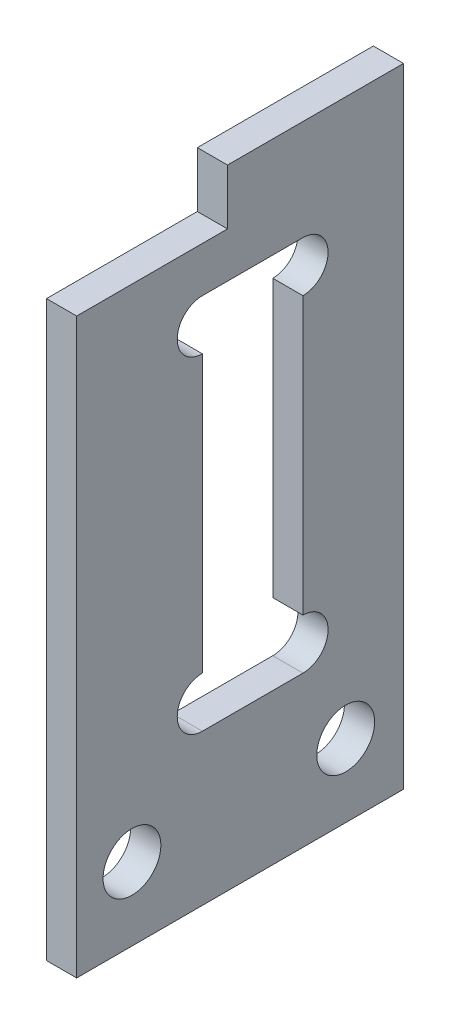
ISO-10303-21;
HEADER;
FILE_DESCRIPTION(('STEP AP214'),'2;1');
FILE_NAME('part.step','',(''),(''),'','','');
FILE_SCHEMA(('AUTOMOTIVE_DESIGN { 1 0 10303 214 1 1 1 1 }'));
ENDSEC;
DATA;
#1=APPLICATION_CONTEXT('core data for automotive mechanical design processes');
#2=APPLICATION_PROTOCOL_DEFINITION('international standard','automotive_design',2000,#1);
#3=PRODUCT_CONTEXT('',#1,'mechanical');
#4=PRODUCT('Part','Part','',(#3));
#5=PRODUCT_RELATED_PRODUCT_CATEGORY('part','',(#4));
#6=PRODUCT_DEFINITION_FORMATION('','',#4);
#7=PRODUCT_DEFINITION_CONTEXT('part definition',#1,'design');
#8=PRODUCT_DEFINITION('design','',#6,#7);
#9=PRODUCT_DEFINITION_SHAPE('','',#8);
#10=(LENGTH_UNIT() NAMED_UNIT(*) SI_UNIT(.MILLI.,.METRE.));
#11=(NAMED_UNIT(*) PLANE_ANGLE_UNIT() SI_UNIT($,.RADIAN.));
#12=(NAMED_UNIT(*) SI_UNIT($,.STERADIAN.) SOLID_ANGLE_UNIT());
#13=UNCERTAINTY_MEASURE_WITH_UNIT(LENGTH_MEASURE(1.E-05),#10,'distance_accuracy_value','');
#14=(GEOMETRIC_REPRESENTATION_CONTEXT(3) GLOBAL_UNCERTAINTY_ASSIGNED_CONTEXT((#13)) GLOBAL_UNIT_ASSIGNED_CONTEXT((#10,
#11,#12)) REPRESENTATION_CONTEXT('',''));
#15=CARTESIAN_POINT('',(0.,0.,0.));
#16=DIRECTION('',(0.,0.,1.));
#17=DIRECTION('',(1.,0.,0.));
#18=AXIS2_PLACEMENT_3D('',#15,#16,#17);
#19=CARTESIAN_POINT('',(1.2,25.,0.));
#20=DIRECTION('',(0.,-1.,0.));
#21=DIRECTION('',(0.,0.,-1.));
#22=AXIS2_PLACEMENT_3D('',#19,#20,#21);
#23=PLANE('',#22);
#24=DIRECTION('',(1.,0.,0.));
#25=VECTOR('',#24,1.);
#26=CARTESIAN_POINT('',(0.,25.,-13.));
#27=LINE('',#26,#25);
#28=CARTESIAN_POINT('',(0.,25.,-13.));
#29=VERTEX_POINT('',#28);
#30=CARTESIAN_POINT('',(1.2,25.,-13.));
#31=VERTEX_POINT('',#30);
#32=EDGE_CURVE('E139',#29,#31,#27,.T.);
#33=ORIENTED_EDGE('',*,*,#32,.F.);
#34=DIRECTION('',(0.,0.,1.));
#35=VECTOR('',#34,1.);
#36=CARTESIAN_POINT('',(0.,25.,0.));
#37=LINE('',#36,#35);
#38=CARTESIAN_POINT('',(0.,25.,-6.));
#39=VERTEX_POINT('',#38);
#40=EDGE_CURVE('E152',#29,#39,#37,.T.);
#41=ORIENTED_EDGE('',*,*,#40,.T.);
#42=DIRECTION('',(1.,0.,0.));
#43=VECTOR('',#42,1.);
#44=CARTESIAN_POINT('',(-0.000999999999999916,25.,-6.));
#45=LINE('',#44,#43);
#46=CARTESIAN_POINT('',(1.2,25.,-6.));
#47=VERTEX_POINT('',#46);
#48=EDGE_CURVE('E148',#39,#47,#45,.T.);
#49=ORIENTED_EDGE('',*,*,#48,.T.);
#50=DIRECTION('',(0.,0.,1.));
#51=VECTOR('',#50,1.);
#52=CARTESIAN_POINT('',(1.2,25.,0.));
#53=LINE('',#52,#51);
#54=EDGE_CURVE('E42',#31,#47,#53,.T.);
#55=ORIENTED_EDGE('',*,*,#54,.F.);
#56=EDGE_LOOP('',(#33,#41,#49,#55));
#57=FACE_BOUND('',#56,.T.);
#58=ADVANCED_FACE('F34',(#57),#23,.F.);
#59=CARTESIAN_POINT('',(1.2,25.,0.));
#60=DIRECTION('',(-1.,0.,0.));
#61=DIRECTION('',(0.,0.,1.));
#62=AXIS2_PLACEMENT_3D('',#59,#60,#61);
#63=PLANE('',#62);
#64=DIRECTION('',(0.,-1.,0.));
#65=VECTOR('',#64,1.);
#66=CARTESIAN_POINT('',(1.2,8.,-5.));
#67=LINE('',#66,#65);
#68=CARTESIAN_POINT('',(1.2,19.,-5.));
#69=VERTEX_POINT('',#68);
#70=CARTESIAN_POINT('',(1.2,8.,-5.));
#71=VERTEX_POINT('',#70);
#72=EDGE_CURVE('E222',#69,#71,#67,.T.);
#73=ORIENTED_EDGE('',*,*,#72,.F.);
#74=CARTESIAN_POINT('',(1.2,20.,-5.));
#75=DIRECTION('',(1.,0.,0.));
#76=DIRECTION('',(0.,0.,1.));
#77=AXIS2_PLACEMENT_3D('',#74,#75,#76);
#78=CIRCLE('',#77,1.);
#79=CARTESIAN_POINT('',(1.2,21.,-5.));
#80=VERTEX_POINT('',#79);
#81=EDGE_CURVE('E49',#80,#69,#78,.T.);
#82=ORIENTED_EDGE('',*,*,#81,.F.);
#83=DIRECTION('',(0.,0.,1.));
#84=VECTOR('',#83,1.);
#85=CARTESIAN_POINT('',(1.2,21.,-5.));
#86=LINE('',#85,#84);
#87=CARTESIAN_POINT('',(1.2,21.,-9.));
#88=VERTEX_POINT('',#87);
#89=EDGE_CURVE('E192',#88,#80,#86,.T.);
#90=ORIENTED_EDGE('',*,*,#89,.F.);
#91=CARTESIAN_POINT('',(1.2,20.,-9.));
#92=DIRECTION('',(1.,0.,0.));
#93=DIRECTION('',(0.,0.,-1.));
#94=AXIS2_PLACEMENT_3D('',#91,#92,#93);
#95=CIRCLE('',#94,1.);
#96=CARTESIAN_POINT('',(1.2,19.,-9.));
#97=VERTEX_POINT('',#96);
#98=EDGE_CURVE('E207',#97,#88,#95,.T.);
#99=ORIENTED_EDGE('',*,*,#98,.F.);
#100=DIRECTION('',(0.,1.,0.));
#101=VECTOR('',#100,1.);
#102=CARTESIAN_POINT('',(1.2,8.,-9.));
#103=LINE('',#102,#101);
#104=CARTESIAN_POINT('',(1.2,8.,-9.));
#105=VERTEX_POINT('',#104);
#106=EDGE_CURVE('E210',#105,#97,#103,.T.);
#107=ORIENTED_EDGE('',*,*,#106,.F.);
#108=CARTESIAN_POINT('',(1.2,7.,-9.));
#109=DIRECTION('',(1.,0.,0.));
#110=DIRECTION('',(0.,0.,1.));
#111=AXIS2_PLACEMENT_3D('',#108,#109,#110);
#112=CIRCLE('',#111,1.);
#113=CARTESIAN_POINT('',(1.2,6.,-9.));
#114=VERTEX_POINT('',#113);
#115=EDGE_CURVE('E213',#114,#105,#112,.T.);
#116=ORIENTED_EDGE('',*,*,#115,.F.);
#117=DIRECTION('',(0.,0.,-1.));
#118=VECTOR('',#117,1.);
#119=CARTESIAN_POINT('',(1.2,6.,-5.));
#120=LINE('',#119,#118);
#121=CARTESIAN_POINT('',(1.2,6.,-5.));
#122=VERTEX_POINT('',#121);
#123=EDGE_CURVE('E216',#122,#114,#120,.T.);
#124=ORIENTED_EDGE('',*,*,#123,.F.);
#125=CARTESIAN_POINT('',(1.2,7.,-5.));
#126=DIRECTION('',(1.,0.,0.));
#127=DIRECTION('',(0.,0.,-1.));
#128=AXIS2_PLACEMENT_3D('',#125,#126,#127);
#129=CIRCLE('',#128,0.999999999999999);
#130=EDGE_CURVE('E219',#71,#122,#129,.T.);
#131=ORIENTED_EDGE('',*,*,#130,.F.);
#132=EDGE_LOOP('',(#73,#82,#90,#99,#107,#116,#124,#131));
#133=FACE_BOUND('',#132,.T.);
#134=CARTESIAN_POINT('',(1.2,2.9,-10.7));
#135=DIRECTION('',(1.,0.,0.));
#136=DIRECTION('',(0.,0.,-1.));
#137=AXIS2_PLACEMENT_3D('',#134,#135,#136);
#138=CIRCLE('',#137,1.15);
#139=CARTESIAN_POINT('',(1.2,2.9,-11.85));
#140=VERTEX_POINT('',#139);
#141=EDGE_CURVE('E246',#140,#140,#138,.T.);
#142=ORIENTED_EDGE('',*,*,#141,.F.);
#143=EDGE_LOOP('',(#142));
#144=FACE_BOUND('',#143,.T.);
#145=CARTESIAN_POINT('',(1.2,2.9,-2.2));
#146=DIRECTION('',(1.,0.,0.));
#147=DIRECTION('',(0.,0.,-1.));
#148=AXIS2_PLACEMENT_3D('',#145,#146,#147);
#149=CIRCLE('',#148,1.15);
#150=CARTESIAN_POINT('',(1.2,2.9,-3.35));
#151=VERTEX_POINT('',#150);
#152=EDGE_CURVE('E250',#151,#151,#149,.T.);
#153=ORIENTED_EDGE('',*,*,#152,.F.);
#154=EDGE_LOOP('',(#153));
#155=FACE_BOUND('',#154,.T.);
#156=DIRECTION('',(0.,-1.,0.));
#157=VECTOR('',#156,1.);
#158=CARTESIAN_POINT('',(1.2,22.,-13.));
#159=LINE('',#158,#157);
#160=CARTESIAN_POINT('',(1.2,0.,-13.));
#161=VERTEX_POINT('',#160);
#162=EDGE_CURVE('E147',#31,#161,#159,.T.);
#163=ORIENTED_EDGE('',*,*,#162,.F.);
#164=ORIENTED_EDGE('',*,*,#54,.T.);
#165=DIRECTION('',(0.,1.,0.));
#166=VECTOR('',#165,1.);
#167=CARTESIAN_POINT('',(1.2,25.,-6.));
#168=LINE('',#167,#166);
#169=CARTESIAN_POINT('',(1.2,22.8,-6.));
#170=VERTEX_POINT('',#169);
#171=EDGE_CURVE('E175',#170,#47,#168,.T.);
#172=ORIENTED_EDGE('',*,*,#171,.F.);
#173=DIRECTION('',(0.,0.,-1.));
#174=VECTOR('',#173,1.);
#175=CARTESIAN_POINT('',(1.2,22.8,-6.));
#176=LINE('',#175,#174);
#177=CARTESIAN_POINT('',(1.2,22.8,0.));
#178=VERTEX_POINT('',#177);
#179=EDGE_CURVE('E180',#178,#170,#176,.T.);
#180=ORIENTED_EDGE('',*,*,#179,.F.);
#181=DIRECTION('',(0.,-1.,0.));
#182=VECTOR('',#181,1.);
#183=CARTESIAN_POINT('',(1.2,0.,0.));
#184=LINE('',#183,#182);
#185=CARTESIAN_POINT('',(1.2,0.,0.));
#186=VERTEX_POINT('',#185);
#187=EDGE_CURVE('E160',#178,#186,#184,.T.);
#188=ORIENTED_EDGE('',*,*,#187,.T.);
#189=DIRECTION('',(0.,0.,-1.));
#190=VECTOR('',#189,1.);
#191=CARTESIAN_POINT('',(1.2,0.,0.));
#192=LINE('',#191,#190);
#193=EDGE_CURVE('E162',#186,#161,#192,.T.);
#194=ORIENTED_EDGE('',*,*,#193,.T.);
#195=EDGE_LOOP('',(#163,#164,#172,#180,#188,#194));
#196=FACE_BOUND('',#195,.T.);
#197=ADVANCED_FACE('F263',(#133,#144,#155,#196),#63,.F.);
#198=CARTESIAN_POINT('',(0.,25.,0.));
#199=DIRECTION('',(-1.,0.,0.));
#200=DIRECTION('',(0.,0.,1.));
#201=AXIS2_PLACEMENT_3D('',#198,#199,#200);
#202=PLANE('',#201);
#203=CARTESIAN_POINT('',(0.,20.,-5.));
#204=DIRECTION('',(-1.,0.,0.));
#205=DIRECTION('',(0.,0.,1.));
#206=AXIS2_PLACEMENT_3D('',#203,#204,#205);
#207=CIRCLE('',#206,1.);
#208=CARTESIAN_POINT('',(0.,21.,-5.));
#209=VERTEX_POINT('',#208);
#210=CARTESIAN_POINT('',(0.,19.,-5.));
#211=VERTEX_POINT('',#210);
#212=EDGE_CURVE('E225',#209,#211,#207,.F.);
#213=ORIENTED_EDGE('',*,*,#212,.T.);
#214=DIRECTION('',(0.,-1.,0.));
#215=VECTOR('',#214,1.);
#216=CARTESIAN_POINT('',(0.,8.,-5.));
#217=LINE('',#216,#215);
#218=CARTESIAN_POINT('',(0.,8.,-5.));
#219=VERTEX_POINT('',#218);
#220=EDGE_CURVE('E186',#211,#219,#217,.T.);
#221=ORIENTED_EDGE('',*,*,#220,.T.);
#222=CARTESIAN_POINT('',(0.,7.,-5.));
#223=DIRECTION('',(-1.,0.,0.));
#224=DIRECTION('',(0.,0.,1.));
#225=AXIS2_PLACEMENT_3D('',#222,#223,#224);
#226=CIRCLE('',#225,0.999999999999999);
#227=CARTESIAN_POINT('',(0.,6.,-5.));
#228=VERTEX_POINT('',#227);
#229=EDGE_CURVE('E243',#219,#228,#226,.F.);
#230=ORIENTED_EDGE('',*,*,#229,.T.);
#231=DIRECTION('',(0.,0.,-1.));
#232=VECTOR('',#231,1.);
#233=CARTESIAN_POINT('',(0.,6.,-5.));
#234=LINE('',#233,#232);
#235=CARTESIAN_POINT('',(0.,6.,-9.));
#236=VERTEX_POINT('',#235);
#237=EDGE_CURVE('E240',#228,#236,#234,.T.);
#238=ORIENTED_EDGE('',*,*,#237,.T.);
#239=CARTESIAN_POINT('',(0.,7.,-9.));
#240=DIRECTION('',(-1.,0.,0.));
#241=DIRECTION('',(0.,0.,1.));
#242=AXIS2_PLACEMENT_3D('',#239,#240,#241);
#243=CIRCLE('',#242,1.);
#244=CARTESIAN_POINT('',(0.,8.,-9.));
#245=VERTEX_POINT('',#244);
#246=EDGE_CURVE('E237',#236,#245,#243,.F.);
#247=ORIENTED_EDGE('',*,*,#246,.T.);
#248=DIRECTION('',(0.,1.,0.));
#249=VECTOR('',#248,1.);
#250=CARTESIAN_POINT('',(0.,8.,-9.));
#251=LINE('',#250,#249);
#252=CARTESIAN_POINT('',(0.,19.,-9.));
#253=VERTEX_POINT('',#252);
#254=EDGE_CURVE('E234',#245,#253,#251,.T.);
#255=ORIENTED_EDGE('',*,*,#254,.T.);
#256=CARTESIAN_POINT('',(0.,20.,-9.));
#257=DIRECTION('',(-1.,0.,0.));
#258=DIRECTION('',(0.,0.,1.));
#259=AXIS2_PLACEMENT_3D('',#256,#257,#258);
#260=CIRCLE('',#259,1.);
#261=CARTESIAN_POINT('',(0.,21.,-9.));
#262=VERTEX_POINT('',#261);
#263=EDGE_CURVE('E231',#253,#262,#260,.F.);
#264=ORIENTED_EDGE('',*,*,#263,.T.);
#265=DIRECTION('',(0.,0.,1.));
#266=VECTOR('',#265,1.);
#267=CARTESIAN_POINT('',(0.,21.,-5.));
#268=LINE('',#267,#266);
#269=EDGE_CURVE('E228',#262,#209,#268,.T.);
#270=ORIENTED_EDGE('',*,*,#269,.T.);
#271=EDGE_LOOP('',(#213,#221,#230,#238,#247,#255,#264,#270));
#272=FACE_BOUND('',#271,.T.);
#273=CARTESIAN_POINT('',(0.,2.9,-10.7));
#274=DIRECTION('',(-1.,0.,0.));
#275=DIRECTION('',(0.,0.,1.));
#276=AXIS2_PLACEMENT_3D('',#273,#274,#275);
#277=CIRCLE('',#276,1.15);
#278=CARTESIAN_POINT('',(0.,2.9,-9.55));
#279=VERTEX_POINT('',#278);
#280=EDGE_CURVE('E247',#279,#279,#277,.F.);
#281=ORIENTED_EDGE('',*,*,#280,.T.);
#282=EDGE_LOOP('',(#281));
#283=FACE_BOUND('',#282,.T.);
#284=CARTESIAN_POINT('',(0.,2.9,-2.2));
#285=DIRECTION('',(-1.,0.,0.));
#286=DIRECTION('',(0.,0.,1.));
#287=AXIS2_PLACEMENT_3D('',#284,#285,#286);
#288=CIRCLE('',#287,1.15);
#289=CARTESIAN_POINT('',(0.,2.9,-1.05));
#290=VERTEX_POINT('',#289);
#291=EDGE_CURVE('E253',#290,#290,#288,.F.);
#292=ORIENTED_EDGE('',*,*,#291,.T.);
#293=EDGE_LOOP('',(#292));
#294=FACE_BOUND('',#293,.T.);
#295=ORIENTED_EDGE('',*,*,#40,.F.);
#296=DIRECTION('',(0.,-1.,0.));
#297=VECTOR('',#296,1.);
#298=CARTESIAN_POINT('',(0.,22.,-13.));
#299=LINE('',#298,#297);
#300=CARTESIAN_POINT('',(0.,0.,-13.));
#301=VERTEX_POINT('',#300);
#302=EDGE_CURVE('E136',#29,#301,#299,.T.);
#303=ORIENTED_EDGE('',*,*,#302,.T.);
#304=DIRECTION('',(0.,0.,-1.));
#305=VECTOR('',#304,1.);
#306=CARTESIAN_POINT('',(0.,0.,0.));
#307=LINE('',#306,#305);
#308=CARTESIAN_POINT('',(0.,0.,0.));
#309=VERTEX_POINT('',#308);
#310=EDGE_CURVE('E161',#309,#301,#307,.T.);
#311=ORIENTED_EDGE('',*,*,#310,.F.);
#312=DIRECTION('',(0.,-1.,0.));
#313=VECTOR('',#312,1.);
#314=CARTESIAN_POINT('',(0.,0.,0.));
#315=LINE('',#314,#313);
#316=CARTESIAN_POINT('',(0.,22.8,0.));
#317=VERTEX_POINT('',#316);
#318=EDGE_CURVE('E164',#317,#309,#315,.T.);
#319=ORIENTED_EDGE('',*,*,#318,.F.);
#320=DIRECTION('',(0.,0.,-1.));
#321=VECTOR('',#320,1.);
#322=CARTESIAN_POINT('',(0.,22.8,-6.));
#323=LINE('',#322,#321);
#324=CARTESIAN_POINT('',(0.,22.8,-6.));
#325=VERTEX_POINT('',#324);
#326=EDGE_CURVE('E184',#317,#325,#323,.T.);
#327=ORIENTED_EDGE('',*,*,#326,.T.);
#328=DIRECTION('',(0.,1.,0.));
#329=VECTOR('',#328,1.);
#330=CARTESIAN_POINT('',(0.,25.,-6.));
#331=LINE('',#330,#329);
#332=EDGE_CURVE('E159',#325,#39,#331,.T.);
#333=ORIENTED_EDGE('',*,*,#332,.T.);
#334=EDGE_LOOP('',(#295,#303,#311,#319,#327,#333));
#335=FACE_BOUND('',#334,.T.);
#336=ADVANCED_FACE('F156',(#272,#283,#294,#335),#202,.T.);
#337=CARTESIAN_POINT('',(1.2,0.,0.));
#338=DIRECTION('',(0.,0.,-1.));
#339=DIRECTION('',(0.,1.,0.));
#340=AXIS2_PLACEMENT_3D('',#337,#338,#339);
#341=PLANE('',#340);
#342=ORIENTED_EDGE('',*,*,#187,.F.);
#343=DIRECTION('',(1.,0.,0.));
#344=VECTOR('',#343,1.);
#345=CARTESIAN_POINT('',(-0.000999999999999916,22.8,0.));
#346=LINE('',#345,#344);
#347=EDGE_CURVE('E172',#317,#178,#346,.T.);
#348=ORIENTED_EDGE('',*,*,#347,.F.);
#349=ORIENTED_EDGE('',*,*,#318,.T.);
#350=DIRECTION('',(-1.,0.,0.));
#351=VECTOR('',#350,1.);
#352=CARTESIAN_POINT('',(1.2,0.,0.));
#353=LINE('',#352,#351);
#354=EDGE_CURVE('E11',#186,#309,#353,.T.);
#355=ORIENTED_EDGE('',*,*,#354,.F.);
#356=EDGE_LOOP('',(#342,#348,#349,#355));
#357=FACE_BOUND('',#356,.T.);
#358=ADVANCED_FACE('F36',(#357),#341,.F.);
#359=CARTESIAN_POINT('',(1.2,0.,0.));
#360=DIRECTION('',(0.,1.,0.));
#361=DIRECTION('',(0.,0.,1.));
#362=AXIS2_PLACEMENT_3D('',#359,#360,#361);
#363=PLANE('',#362);
#364=ORIENTED_EDGE('',*,*,#310,.T.);
#365=DIRECTION('',(1.,0.,0.));
#366=VECTOR('',#365,1.);
#367=CARTESIAN_POINT('',(0.,0.,-13.));
#368=LINE('',#367,#366);
#369=EDGE_CURVE('E142',#301,#161,#368,.T.);
#370=ORIENTED_EDGE('',*,*,#369,.T.);
#371=ORIENTED_EDGE('',*,*,#193,.F.);
#372=ORIENTED_EDGE('',*,*,#354,.T.);
#373=EDGE_LOOP('',(#364,#370,#371,#372));
#374=FACE_BOUND('',#373,.T.);
#375=ADVANCED_FACE('F260',(#374),#363,.F.);
#376=CARTESIAN_POINT('',(-0.000999999999999916,22.,-13.));
#377=DIRECTION('',(0.,0.,1.));
#378=DIRECTION('',(0.,-1.,0.));
#379=AXIS2_PLACEMENT_3D('',#376,#377,#378);
#380=PLANE('',#379);
#381=ORIENTED_EDGE('',*,*,#302,.F.);
#382=ORIENTED_EDGE('',*,*,#32,.T.);
#383=ORIENTED_EDGE('',*,*,#162,.T.);
#384=ORIENTED_EDGE('',*,*,#369,.F.);
#385=EDGE_LOOP('',(#381,#382,#383,#384));
#386=FACE_BOUND('',#385,.T.);
#387=ADVANCED_FACE('F138',(#386),#380,.F.);
#388=CARTESIAN_POINT('',(-0.000999999999999916,25.,-6.));
#389=DIRECTION('',(0.,0.,-1.));
#390=DIRECTION('',(0.,1.,0.));
#391=AXIS2_PLACEMENT_3D('',#388,#389,#390);
#392=PLANE('',#391);
#393=DIRECTION('',(1.,0.,0.));
#394=VECTOR('',#393,1.);
#395=CARTESIAN_POINT('',(-0.000999999999999916,22.8,-6.));
#396=LINE('',#395,#394);
#397=EDGE_CURVE('E174',#325,#170,#396,.T.);
#398=ORIENTED_EDGE('',*,*,#397,.T.);
#399=ORIENTED_EDGE('',*,*,#171,.T.);
#400=ORIENTED_EDGE('',*,*,#48,.F.);
#401=ORIENTED_EDGE('',*,*,#332,.F.);
#402=EDGE_LOOP('',(#398,#399,#400,#401));
#403=FACE_BOUND('',#402,.T.);
#404=ADVANCED_FACE('F273',(#403),#392,.F.);
#405=CARTESIAN_POINT('',(-0.000999999999999916,22.8,-6.));
#406=DIRECTION('',(0.,-1.,0.));
#407=DIRECTION('',(0.,0.,-1.));
#408=AXIS2_PLACEMENT_3D('',#405,#406,#407);
#409=PLANE('',#408);
#410=ORIENTED_EDGE('',*,*,#347,.T.);
#411=ORIENTED_EDGE('',*,*,#179,.T.);
#412=ORIENTED_EDGE('',*,*,#397,.F.);
#413=ORIENTED_EDGE('',*,*,#326,.F.);
#414=EDGE_LOOP('',(#410,#411,#412,#413));
#415=FACE_BOUND('',#414,.T.);
#416=ADVANCED_FACE('F271',(#415),#409,.F.);
#417=CARTESIAN_POINT('',(-0.000999999999999916,20.,-5.));
#418=DIRECTION('',(1.,0.,0.));
#419=DIRECTION('',(0.,0.,-1.));
#420=AXIS2_PLACEMENT_3D('',#417,#418,#419);
#421=CYLINDRICAL_SURFACE('',#420,1.);
#422=DIRECTION('',(1.,0.,0.));
#423=VECTOR('',#422,1.);
#424=CARTESIAN_POINT('',(-0.000999999999999916,21.,-5.));
#425=LINE('',#424,#423);
#426=EDGE_CURVE('E189',#209,#80,#425,.T.);
#427=ORIENTED_EDGE('',*,*,#426,.T.);
#428=ORIENTED_EDGE('',*,*,#81,.T.);
#429=DIRECTION('',(1.,0.,0.));
#430=VECTOR('',#429,1.);
#431=CARTESIAN_POINT('',(-0.000999999999999916,19.,-5.));
#432=LINE('',#431,#430);
#433=EDGE_CURVE('E190',#211,#69,#432,.T.);
#434=ORIENTED_EDGE('',*,*,#433,.F.);
#435=ORIENTED_EDGE('',*,*,#212,.F.);
#436=EDGE_LOOP('',(#427,#428,#434,#435));
#437=FACE_BOUND('',#436,.T.);
#438=ADVANCED_FACE('F280',(#437),#421,.F.);
#439=CARTESIAN_POINT('',(-0.000999999999999916,21.,-5.));
#440=DIRECTION('',(0.,1.,0.));
#441=DIRECTION('',(0.,0.,1.));
#442=AXIS2_PLACEMENT_3D('',#439,#440,#441);
#443=PLANE('',#442);
#444=DIRECTION('',(1.,0.,0.));
#445=VECTOR('',#444,1.);
#446=CARTESIAN_POINT('',(-0.000999999999999916,21.,-9.));
#447=LINE('',#446,#445);
#448=EDGE_CURVE('E202',#262,#88,#447,.T.);
#449=ORIENTED_EDGE('',*,*,#448,.T.);
#450=ORIENTED_EDGE('',*,*,#89,.T.);
#451=ORIENTED_EDGE('',*,*,#426,.F.);
#452=ORIENTED_EDGE('',*,*,#269,.F.);
#453=EDGE_LOOP('',(#449,#450,#451,#452));
#454=FACE_BOUND('',#453,.T.);
#455=ADVANCED_FACE('F322',(#454),#443,.F.);
#456=CARTESIAN_POINT('',(-0.000999999999999916,20.,-9.));
#457=DIRECTION('',(1.,0.,0.));
#458=DIRECTION('',(0.,0.,-1.));
#459=AXIS2_PLACEMENT_3D('',#456,#457,#458);
#460=CYLINDRICAL_SURFACE('',#459,1.);
#461=DIRECTION('',(1.,0.,0.));
#462=VECTOR('',#461,1.);
#463=CARTESIAN_POINT('',(-0.000999999999999916,19.,-9.));
#464=LINE('',#463,#462);
#465=EDGE_CURVE('E200',#253,#97,#464,.T.);
#466=ORIENTED_EDGE('',*,*,#465,.T.);
#467=ORIENTED_EDGE('',*,*,#98,.T.);
#468=ORIENTED_EDGE('',*,*,#448,.F.);
#469=ORIENTED_EDGE('',*,*,#263,.F.);
#470=EDGE_LOOP('',(#466,#467,#468,#469));
#471=FACE_BOUND('',#470,.T.);
#472=ADVANCED_FACE('F325',(#471),#460,.F.);
#473=CARTESIAN_POINT('',(-0.000999999999999916,8.,-9.));
#474=DIRECTION('',(0.,0.,-1.));
#475=DIRECTION('',(-1.,0.,0.));
#476=AXIS2_PLACEMENT_3D('',#473,#474,#475);
#477=PLANE('',#476);
#478=DIRECTION('',(1.,0.,0.));
#479=VECTOR('',#478,1.);
#480=CARTESIAN_POINT('',(-0.000999999999999916,8.,-9.));
#481=LINE('',#480,#479);
#482=EDGE_CURVE('E198',#245,#105,#481,.T.);
#483=ORIENTED_EDGE('',*,*,#482,.T.);
#484=ORIENTED_EDGE('',*,*,#106,.T.);
#485=ORIENTED_EDGE('',*,*,#465,.F.);
#486=ORIENTED_EDGE('',*,*,#254,.F.);
#487=EDGE_LOOP('',(#483,#484,#485,#486));
#488=FACE_BOUND('',#487,.T.);
#489=ADVANCED_FACE('F329',(#488),#477,.F.);
#490=CARTESIAN_POINT('',(-0.000999999999999916,7.,-9.));
#491=DIRECTION('',(1.,0.,0.));
#492=DIRECTION('',(0.,0.,-1.));
#493=AXIS2_PLACEMENT_3D('',#490,#491,#492);
#494=CYLINDRICAL_SURFACE('',#493,1.);
#495=DIRECTION('',(1.,0.,0.));
#496=VECTOR('',#495,1.);
#497=CARTESIAN_POINT('',(-0.000999999999999916,6.,-9.));
#498=LINE('',#497,#496);
#499=EDGE_CURVE('E196',#236,#114,#498,.T.);
#500=ORIENTED_EDGE('',*,*,#499,.T.);
#501=ORIENTED_EDGE('',*,*,#115,.T.);
#502=ORIENTED_EDGE('',*,*,#482,.F.);
#503=ORIENTED_EDGE('',*,*,#246,.F.);
#504=EDGE_LOOP('',(#500,#501,#502,#503));
#505=FACE_BOUND('',#504,.T.);
#506=ADVANCED_FACE('F333',(#505),#494,.F.);
#507=CARTESIAN_POINT('',(-0.000999999999999916,6.,-5.));
#508=DIRECTION('',(0.,-1.,0.));
#509=DIRECTION('',(0.,0.,-1.));
#510=AXIS2_PLACEMENT_3D('',#507,#508,#509);
#511=PLANE('',#510);
#512=DIRECTION('',(1.,0.,0.));
#513=VECTOR('',#512,1.);
#514=CARTESIAN_POINT('',(-0.000999999999999916,6.,-5.));
#515=LINE('',#514,#513);
#516=EDGE_CURVE('E194',#228,#122,#515,.T.);
#517=ORIENTED_EDGE('',*,*,#516,.T.);
#518=ORIENTED_EDGE('',*,*,#123,.T.);
#519=ORIENTED_EDGE('',*,*,#499,.F.);
#520=ORIENTED_EDGE('',*,*,#237,.F.);
#521=EDGE_LOOP('',(#517,#518,#519,#520));
#522=FACE_BOUND('',#521,.T.);
#523=ADVANCED_FACE('F337',(#522),#511,.F.);
#524=CARTESIAN_POINT('',(-0.000999999999999916,7.,-5.));
#525=DIRECTION('',(1.,0.,0.));
#526=DIRECTION('',(0.,0.,-1.));
#527=AXIS2_PLACEMENT_3D('',#524,#525,#526);
#528=CYLINDRICAL_SURFACE('',#527,0.999999999999999);
#529=DIRECTION('',(1.,0.,0.));
#530=VECTOR('',#529,1.);
#531=CARTESIAN_POINT('',(-0.000999999999999916,8.,-5.));
#532=LINE('',#531,#530);
#533=EDGE_CURVE('E57',#219,#71,#532,.T.);
#534=ORIENTED_EDGE('',*,*,#533,.T.);
#535=ORIENTED_EDGE('',*,*,#130,.T.);
#536=ORIENTED_EDGE('',*,*,#516,.F.);
#537=ORIENTED_EDGE('',*,*,#229,.F.);
#538=EDGE_LOOP('',(#534,#535,#536,#537));
#539=FACE_BOUND('',#538,.T.);
#540=ADVANCED_FACE('F341',(#539),#528,.F.);
#541=CARTESIAN_POINT('',(-0.000999999999999916,8.,-5.));
#542=DIRECTION('',(0.,0.,1.));
#543=DIRECTION('',(0.,-1.,0.));
#544=AXIS2_PLACEMENT_3D('',#541,#542,#543);
#545=PLANE('',#544);
#546=ORIENTED_EDGE('',*,*,#433,.T.);
#547=ORIENTED_EDGE('',*,*,#72,.T.);
#548=ORIENTED_EDGE('',*,*,#533,.F.);
#549=ORIENTED_EDGE('',*,*,#220,.F.);
#550=EDGE_LOOP('',(#546,#547,#548,#549));
#551=FACE_BOUND('',#550,.T.);
#552=ADVANCED_FACE('F318',(#551),#545,.F.);
#553=CARTESIAN_POINT('',(-0.000999999999999916,2.9,-10.7));
#554=DIRECTION('',(1.,0.,0.));
#555=DIRECTION('',(0.,0.,-1.));
#556=AXIS2_PLACEMENT_3D('',#553,#554,#555);
#557=CYLINDRICAL_SURFACE('',#556,1.15);
#558=ORIENTED_EDGE('',*,*,#280,.F.);
#559=EDGE_LOOP('',(#558));
#560=FACE_BOUND('',#559,.T.);
#561=ORIENTED_EDGE('',*,*,#141,.T.);
#562=EDGE_LOOP('',(#561));
#563=FACE_BOUND('',#562,.T.);
#564=ADVANCED_FACE('F311',(#560,#563),#557,.F.);
#565=CARTESIAN_POINT('',(-0.000999999999999916,2.9,-2.2));
#566=DIRECTION('',(1.,0.,0.));
#567=DIRECTION('',(0.,0.,-1.));
#568=AXIS2_PLACEMENT_3D('',#565,#566,#567);
#569=CYLINDRICAL_SURFACE('',#568,1.15);
#570=ORIENTED_EDGE('',*,*,#291,.F.);
#571=EDGE_LOOP('',(#570));
#572=FACE_BOUND('',#571,.T.);
#573=ORIENTED_EDGE('',*,*,#152,.T.);
#574=EDGE_LOOP('',(#573));
#575=FACE_BOUND('',#574,.T.);
#576=ADVANCED_FACE('F308',(#572,#575),#569,.F.);
#577=CLOSED_SHELL('',(#58,#197,#336,#358,#375,#387,#404,#416,#438,#455,#472,#489,#506,#523,#540,
#552,#564,#576));
#578=MANIFOLD_SOLID_BREP('B2',#577);
#579=ADVANCED_BREP_SHAPE_REPRESENTATION('',(#18,#578),#14);
#580=SHAPE_DEFINITION_REPRESENTATION(#9,#579);
ENDSEC;
END-ISO-10303-21;
